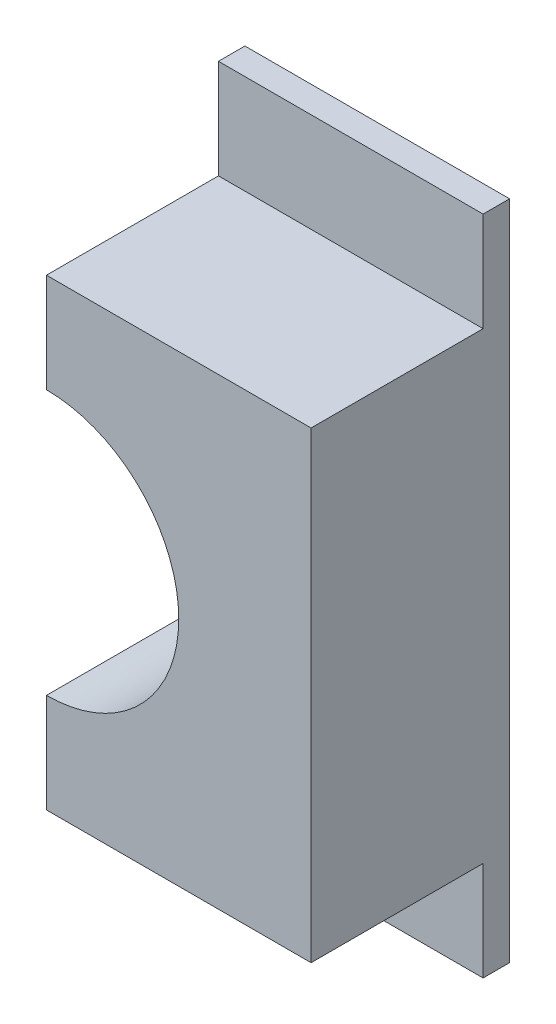
ISO-10303-21;
HEADER;
FILE_DESCRIPTION(('STEP AP214'),'2;1');
FILE_NAME('part.step','',(''),(''),'','','');
FILE_SCHEMA(('AUTOMOTIVE_DESIGN { 1 0 10303 214 1 1 1 1 }'));
ENDSEC;
DATA;
#1=APPLICATION_CONTEXT('core data for automotive mechanical design processes');
#2=APPLICATION_PROTOCOL_DEFINITION('international standard','automotive_design',2000,#1);
#3=PRODUCT_CONTEXT('',#1,'mechanical');
#4=PRODUCT('Part','Part','',(#3));
#5=PRODUCT_RELATED_PRODUCT_CATEGORY('part','',(#4));
#6=PRODUCT_DEFINITION_FORMATION('','',#4);
#7=PRODUCT_DEFINITION_CONTEXT('part definition',#1,'design');
#8=PRODUCT_DEFINITION('design','',#6,#7);
#9=PRODUCT_DEFINITION_SHAPE('','',#8);
#10=(LENGTH_UNIT() NAMED_UNIT(*) SI_UNIT(.MILLI.,.METRE.));
#11=(NAMED_UNIT(*) PLANE_ANGLE_UNIT() SI_UNIT($,.RADIAN.));
#12=(NAMED_UNIT(*) SI_UNIT($,.STERADIAN.) SOLID_ANGLE_UNIT());
#13=UNCERTAINTY_MEASURE_WITH_UNIT(LENGTH_MEASURE(1.E-05),#10,'distance_accuracy_value','');
#14=(GEOMETRIC_REPRESENTATION_CONTEXT(3) GLOBAL_UNCERTAINTY_ASSIGNED_CONTEXT((#13)) GLOBAL_UNIT_ASSIGNED_CONTEXT((#10,
#11,#12)) REPRESENTATION_CONTEXT('',''));
#15=CARTESIAN_POINT('',(0.,0.,0.));
#16=DIRECTION('',(0.,0.,1.));
#17=DIRECTION('',(1.,0.,0.));
#18=AXIS2_PLACEMENT_3D('',#15,#16,#17);
#19=CARTESIAN_POINT('',(-0.2,-0.5,0.04));
#20=DIRECTION('',(0.,0.,1.));
#21=DIRECTION('',(1.,0.,0.));
#22=AXIS2_PLACEMENT_3D('',#19,#20,#21);
#23=PLANE('',#22);
#24=DIRECTION('',(1.,0.,0.));
#25=VECTOR('',#24,1.);
#26=CARTESIAN_POINT('',(0.2,0.5,0.04));
#27=LINE('',#26,#25);
#28=CARTESIAN_POINT('',(0.2,0.5,0.04));
#29=VERTEX_POINT('',#28);
#30=CARTESIAN_POINT('',(-0.2,0.5,0.04));
#31=VERTEX_POINT('',#30);
#32=EDGE_CURVE('E156',#29,#31,#27,.F.);
#33=ORIENTED_EDGE('',*,*,#32,.T.);
#34=DIRECTION('',(0.,1.,0.));
#35=VECTOR('',#34,1.);
#36=CARTESIAN_POINT('',(-0.2,0.35,0.04));
#37=LINE('',#36,#35);
#38=CARTESIAN_POINT('',(-0.2,0.35,0.04));
#39=VERTEX_POINT('',#38);
#40=EDGE_CURVE('E146',#31,#39,#37,.F.);
#41=ORIENTED_EDGE('',*,*,#40,.T.);
#42=DIRECTION('',(1.,0.,0.));
#43=VECTOR('',#42,1.);
#44=CARTESIAN_POINT('',(0.2,0.35,0.04));
#45=LINE('',#44,#43);
#46=CARTESIAN_POINT('',(0.2,0.35,0.04));
#47=VERTEX_POINT('',#46);
#48=EDGE_CURVE('E80',#39,#47,#45,.T.);
#49=ORIENTED_EDGE('',*,*,#48,.T.);
#50=DIRECTION('',(0.,1.,0.));
#51=VECTOR('',#50,1.);
#52=CARTESIAN_POINT('',(0.2,-0.35,0.04));
#53=LINE('',#52,#51);
#54=EDGE_CURVE('E161',#47,#29,#53,.T.);
#55=ORIENTED_EDGE('',*,*,#54,.T.);
#56=EDGE_LOOP('',(#33,#41,#49,#55));
#57=FACE_BOUND('',#56,.T.);
#58=ADVANCED_FACE('F16',(#57),#23,.T.);
#59=CARTESIAN_POINT('',(0.2,0.35,0.3));
#60=DIRECTION('',(0.,-1.,0.));
#61=DIRECTION('',(0.,0.,-1.));
#62=AXIS2_PLACEMENT_3D('',#59,#60,#61);
#63=PLANE('',#62);
#64=ORIENTED_EDGE('',*,*,#48,.F.);
#65=DIRECTION('',(0.,0.,-1.));
#66=VECTOR('',#65,1.);
#67=CARTESIAN_POINT('',(-0.2,0.35,0.3));
#68=LINE('',#67,#66);
#69=CARTESIAN_POINT('',(-0.2,0.35,0.3));
#70=VERTEX_POINT('',#69);
#71=EDGE_CURVE('E138',#39,#70,#68,.F.);
#72=ORIENTED_EDGE('',*,*,#71,.T.);
#73=DIRECTION('',(1.,0.,0.));
#74=VECTOR('',#73,1.);
#75=CARTESIAN_POINT('',(-0.2,0.35,0.3));
#76=LINE('',#75,#74);
#77=CARTESIAN_POINT('',(0.2,0.35,0.3));
#78=VERTEX_POINT('',#77);
#79=EDGE_CURVE('E56',#78,#70,#76,.F.);
#80=ORIENTED_EDGE('',*,*,#79,.F.);
#81=DIRECTION('',(0.,0.,1.));
#82=VECTOR('',#81,1.);
#83=CARTESIAN_POINT('',(0.2,0.35,0.3));
#84=LINE('',#83,#82);
#85=EDGE_CURVE('E163',#78,#47,#84,.F.);
#86=ORIENTED_EDGE('',*,*,#85,.T.);
#87=EDGE_LOOP('',(#64,#72,#80,#86));
#88=FACE_BOUND('',#87,.T.);
#89=ADVANCED_FACE('F245',(#88),#63,.F.);
#90=CARTESIAN_POINT('',(-0.2,-0.35,0.3));
#91=DIRECTION('',(0.,1.,0.));
#92=DIRECTION('',(0.,0.,1.));
#93=AXIS2_PLACEMENT_3D('',#90,#91,#92);
#94=PLANE('',#93);
#95=DIRECTION('',(1.,0.,0.));
#96=VECTOR('',#95,1.);
#97=CARTESIAN_POINT('',(-0.2,-0.35,0.04));
#98=LINE('',#97,#96);
#99=CARTESIAN_POINT('',(0.2,-0.35,0.04));
#100=VERTEX_POINT('',#99);
#101=CARTESIAN_POINT('',(-0.2,-0.35,0.04));
#102=VERTEX_POINT('',#101);
#103=EDGE_CURVE('E123',#100,#102,#98,.F.);
#104=ORIENTED_EDGE('',*,*,#103,.F.);
#105=DIRECTION('',(0.,0.,1.));
#106=VECTOR('',#105,1.);
#107=CARTESIAN_POINT('',(0.2,-0.35,0.3));
#108=LINE('',#107,#106);
#109=CARTESIAN_POINT('',(0.2,-0.35,0.3));
#110=VERTEX_POINT('',#109);
#111=EDGE_CURVE('E168',#100,#110,#108,.T.);
#112=ORIENTED_EDGE('',*,*,#111,.T.);
#113=DIRECTION('',(1.,0.,0.));
#114=VECTOR('',#113,1.);
#115=CARTESIAN_POINT('',(-0.2,-0.35,0.3));
#116=LINE('',#115,#114);
#117=CARTESIAN_POINT('',(-0.2,-0.35,0.3));
#118=VERTEX_POINT('',#117);
#119=EDGE_CURVE('E133',#118,#110,#116,.T.);
#120=ORIENTED_EDGE('',*,*,#119,.F.);
#121=DIRECTION('',(0.,0.,-1.));
#122=VECTOR('',#121,1.);
#123=CARTESIAN_POINT('',(-0.2,-0.35,0.3));
#124=LINE('',#123,#122);
#125=EDGE_CURVE('E124',#118,#102,#124,.T.);
#126=ORIENTED_EDGE('',*,*,#125,.T.);
#127=EDGE_LOOP('',(#104,#112,#120,#126));
#128=FACE_BOUND('',#127,.T.);
#129=ADVANCED_FACE('F239',(#128),#94,.F.);
#130=CARTESIAN_POINT('',(-0.2,-0.5,0.04));
#131=DIRECTION('',(0.,0.,1.));
#132=DIRECTION('',(1.,0.,0.));
#133=AXIS2_PLACEMENT_3D('',#130,#131,#132);
#134=PLANE('',#133);
#135=DIRECTION('',(1.,0.,0.));
#136=VECTOR('',#135,1.);
#137=CARTESIAN_POINT('',(-0.2,-0.5,0.04));
#138=LINE('',#137,#136);
#139=CARTESIAN_POINT('',(-0.2,-0.5,0.04));
#140=VERTEX_POINT('',#139);
#141=CARTESIAN_POINT('',(0.2,-0.5,0.04));
#142=VERTEX_POINT('',#141);
#143=EDGE_CURVE('E87',#140,#142,#138,.T.);
#144=ORIENTED_EDGE('',*,*,#143,.T.);
#145=DIRECTION('',(0.,1.,0.));
#146=VECTOR('',#145,1.);
#147=CARTESIAN_POINT('',(0.2,-0.35,0.04));
#148=LINE('',#147,#146);
#149=EDGE_CURVE('E166',#142,#100,#148,.T.);
#150=ORIENTED_EDGE('',*,*,#149,.T.);
#151=ORIENTED_EDGE('',*,*,#103,.T.);
#152=DIRECTION('',(0.,1.,0.));
#153=VECTOR('',#152,1.);
#154=CARTESIAN_POINT('',(-0.2,0.35,0.04));
#155=LINE('',#154,#153);
#156=EDGE_CURVE('E119',#102,#140,#155,.F.);
#157=ORIENTED_EDGE('',*,*,#156,.T.);
#158=EDGE_LOOP('',(#144,#150,#151,#157));
#159=FACE_BOUND('',#158,.T.);
#160=ADVANCED_FACE('F122',(#159),#134,.T.);
#161=CARTESIAN_POINT('',(-0.2,-0.35,0.3));
#162=DIRECTION('',(0.,0.,1.));
#163=DIRECTION('',(1.,0.,0.));
#164=AXIS2_PLACEMENT_3D('',#161,#162,#163);
#165=PLANE('',#164);
#166=ORIENTED_EDGE('',*,*,#79,.T.);
#167=DIRECTION('',(0.,1.,0.));
#168=VECTOR('',#167,1.);
#169=CARTESIAN_POINT('',(-0.2,0.35,0.3));
#170=LINE('',#169,#168);
#171=CARTESIAN_POINT('',(-0.2,0.2,0.3));
#172=VERTEX_POINT('',#171);
#173=EDGE_CURVE('E47',#70,#172,#170,.F.);
#174=ORIENTED_EDGE('',*,*,#173,.T.);
#175=CARTESIAN_POINT('',(-0.2,0.,0.3));
#176=DIRECTION('',(0.,0.,1.));
#177=DIRECTION('',(1.,0.,0.));
#178=AXIS2_PLACEMENT_3D('',#175,#176,#177);
#179=CIRCLE('',#178,0.2);
#180=CARTESIAN_POINT('',(-0.2,-0.2,0.3));
#181=VERTEX_POINT('',#180);
#182=EDGE_CURVE('E19',#172,#181,#179,.F.);
#183=ORIENTED_EDGE('',*,*,#182,.T.);
#184=DIRECTION('',(0.,1.,0.));
#185=VECTOR('',#184,1.);
#186=CARTESIAN_POINT('',(-0.2,0.35,0.3));
#187=LINE('',#186,#185);
#188=EDGE_CURVE('E199',#181,#118,#187,.F.);
#189=ORIENTED_EDGE('',*,*,#188,.T.);
#190=ORIENTED_EDGE('',*,*,#119,.T.);
#191=DIRECTION('',(0.,1.,0.));
#192=VECTOR('',#191,1.);
#193=CARTESIAN_POINT('',(0.2,-0.35,0.3));
#194=LINE('',#193,#192);
#195=EDGE_CURVE('E115',#110,#78,#194,.T.);
#196=ORIENTED_EDGE('',*,*,#195,.T.);
#197=EDGE_LOOP('',(#166,#174,#183,#189,#190,#196));
#198=FACE_BOUND('',#197,.T.);
#199=ADVANCED_FACE('F233',(#198),#165,.T.);
#200=CARTESIAN_POINT('',(-0.2,-0.5,0.04));
#201=DIRECTION('',(0.,1.,0.));
#202=DIRECTION('',(0.,0.,1.));
#203=AXIS2_PLACEMENT_3D('',#200,#201,#202);
#204=PLANE('',#203);
#205=DIRECTION('',(0.,0.,1.));
#206=VECTOR('',#205,1.);
#207=CARTESIAN_POINT('',(0.2,-0.5,0.3));
#208=LINE('',#207,#206);
#209=CARTESIAN_POINT('',(0.2,-0.5,0.));
#210=VERTEX_POINT('',#209);
#211=EDGE_CURVE('E114',#210,#142,#208,.T.);
#212=ORIENTED_EDGE('',*,*,#211,.T.);
#213=ORIENTED_EDGE('',*,*,#143,.F.);
#214=DIRECTION('',(0.,0.,-1.));
#215=VECTOR('',#214,1.);
#216=CARTESIAN_POINT('',(-0.2,-0.5,0.3));
#217=LINE('',#216,#215);
#218=CARTESIAN_POINT('',(-0.2,-0.5,0.));
#219=VERTEX_POINT('',#218);
#220=EDGE_CURVE('E113',#140,#219,#217,.T.);
#221=ORIENTED_EDGE('',*,*,#220,.T.);
#222=DIRECTION('',(1.,0.,0.));
#223=VECTOR('',#222,1.);
#224=CARTESIAN_POINT('',(-0.2,-0.5,0.));
#225=LINE('',#224,#223);
#226=EDGE_CURVE('E106',#219,#210,#225,.T.);
#227=ORIENTED_EDGE('',*,*,#226,.T.);
#228=EDGE_LOOP('',(#212,#213,#221,#227));
#229=FACE_BOUND('',#228,.T.);
#230=ADVANCED_FACE('F112',(#229),#204,.F.);
#231=CARTESIAN_POINT('',(0.2,-0.35,0.3));
#232=DIRECTION('',(-1.,0.,0.));
#233=DIRECTION('',(0.,0.,1.));
#234=AXIS2_PLACEMENT_3D('',#231,#232,#233);
#235=PLANE('',#234);
#236=ORIENTED_EDGE('',*,*,#149,.F.);
#237=ORIENTED_EDGE('',*,*,#211,.F.);
#238=DIRECTION('',(0.,1.,0.));
#239=VECTOR('',#238,1.);
#240=CARTESIAN_POINT('',(0.2,-0.35,0.));
#241=LINE('',#240,#239);
#242=CARTESIAN_POINT('',(0.2,0.5,0.));
#243=VERTEX_POINT('',#242);
#244=EDGE_CURVE('E192',#210,#243,#241,.T.);
#245=ORIENTED_EDGE('',*,*,#244,.T.);
#246=DIRECTION('',(0.,0.,-1.));
#247=VECTOR('',#246,1.);
#248=CARTESIAN_POINT('',(0.2,0.5,0.04));
#249=LINE('',#248,#247);
#250=EDGE_CURVE('E158',#243,#29,#249,.F.);
#251=ORIENTED_EDGE('',*,*,#250,.T.);
#252=ORIENTED_EDGE('',*,*,#54,.F.);
#253=ORIENTED_EDGE('',*,*,#85,.F.);
#254=ORIENTED_EDGE('',*,*,#195,.F.);
#255=ORIENTED_EDGE('',*,*,#111,.F.);
#256=EDGE_LOOP('',(#236,#237,#245,#251,#252,#253,#254,#255));
#257=FACE_BOUND('',#256,.T.);
#258=ADVANCED_FACE('F238',(#257),#235,.F.);
#259=CARTESIAN_POINT('',(0.2,0.5,0.04));
#260=DIRECTION('',(0.,-1.,0.));
#261=DIRECTION('',(0.,0.,-1.));
#262=AXIS2_PLACEMENT_3D('',#259,#260,#261);
#263=PLANE('',#262);
#264=DIRECTION('',(0.,0.,-1.));
#265=VECTOR('',#264,1.);
#266=CARTESIAN_POINT('',(-0.2,0.5,0.3));
#267=LINE('',#266,#265);
#268=CARTESIAN_POINT('',(-0.2,0.5,0.));
#269=VERTEX_POINT('',#268);
#270=EDGE_CURVE('E153',#269,#31,#267,.F.);
#271=ORIENTED_EDGE('',*,*,#270,.T.);
#272=ORIENTED_EDGE('',*,*,#32,.F.);
#273=ORIENTED_EDGE('',*,*,#250,.F.);
#274=DIRECTION('',(1.,0.,0.));
#275=VECTOR('',#274,1.);
#276=CARTESIAN_POINT('',(-0.2,0.5,0.));
#277=LINE('',#276,#275);
#278=EDGE_CURVE('E186',#243,#269,#277,.F.);
#279=ORIENTED_EDGE('',*,*,#278,.T.);
#280=EDGE_LOOP('',(#271,#272,#273,#279));
#281=FACE_BOUND('',#280,.T.);
#282=ADVANCED_FACE('F265',(#281),#263,.F.);
#283=CARTESIAN_POINT('',(-0.2,0.35,0.3));
#284=DIRECTION('',(1.,0.,0.));
#285=DIRECTION('',(0.,0.,-1.));
#286=AXIS2_PLACEMENT_3D('',#283,#284,#285);
#287=PLANE('',#286);
#288=DIRECTION('',(0.,0.,1.));
#289=VECTOR('',#288,1.);
#290=CARTESIAN_POINT('',(-0.2,0.2,1.204159457879));
#291=LINE('',#290,#289);
#292=CARTESIAN_POINT('',(-0.2,0.2,0.));
#293=VERTEX_POINT('',#292);
#294=EDGE_CURVE('E137',#293,#172,#291,.T.);
#295=ORIENTED_EDGE('',*,*,#294,.T.);
#296=ORIENTED_EDGE('',*,*,#173,.F.);
#297=ORIENTED_EDGE('',*,*,#71,.F.);
#298=ORIENTED_EDGE('',*,*,#40,.F.);
#299=ORIENTED_EDGE('',*,*,#270,.F.);
#300=DIRECTION('',(0.,1.,0.));
#301=VECTOR('',#300,1.);
#302=CARTESIAN_POINT('',(-0.2,-0.35,0.));
#303=LINE('',#302,#301);
#304=EDGE_CURVE('E182',#269,#293,#303,.F.);
#305=ORIENTED_EDGE('',*,*,#304,.T.);
#306=EDGE_LOOP('',(#295,#296,#297,#298,#299,#305));
#307=FACE_BOUND('',#306,.T.);
#308=ADVANCED_FACE('F241',(#307),#287,.F.);
#309=CARTESIAN_POINT('',(-0.2,0.,1.204159457879));
#310=DIRECTION('',(0.,0.,1.));
#311=DIRECTION('',(1.,0.,0.));
#312=AXIS2_PLACEMENT_3D('',#309,#310,#311);
#313=CYLINDRICAL_SURFACE('',#312,0.2);
#314=ORIENTED_EDGE('',*,*,#294,.F.);
#315=CARTESIAN_POINT('',(-0.2,0.,0.));
#316=DIRECTION('',(0.,0.,1.));
#317=DIRECTION('',(1.,0.,0.));
#318=AXIS2_PLACEMENT_3D('',#315,#316,#317);
#319=CIRCLE('',#318,0.2);
#320=CARTESIAN_POINT('',(-0.2,-0.2,0.));
#321=VERTEX_POINT('',#320);
#322=EDGE_CURVE('E25',#293,#321,#319,.F.);
#323=ORIENTED_EDGE('',*,*,#322,.T.);
#324=DIRECTION('',(0.,0.,-1.));
#325=VECTOR('',#324,1.);
#326=CARTESIAN_POINT('',(-0.2,-0.2,0.3));
#327=LINE('',#326,#325);
#328=EDGE_CURVE('E33',#321,#181,#327,.F.);
#329=ORIENTED_EDGE('',*,*,#328,.T.);
#330=ORIENTED_EDGE('',*,*,#182,.F.);
#331=EDGE_LOOP('',(#314,#323,#329,#330));
#332=FACE_BOUND('',#331,.T.);
#333=ADVANCED_FACE('F240',(#332),#313,.F.);
#334=CARTESIAN_POINT('',(-0.2,0.35,0.3));
#335=DIRECTION('',(1.,0.,0.));
#336=DIRECTION('',(0.,0.,-1.));
#337=AXIS2_PLACEMENT_3D('',#334,#335,#336);
#338=PLANE('',#337);
#339=ORIENTED_EDGE('',*,*,#328,.F.);
#340=DIRECTION('',(0.,1.,0.));
#341=VECTOR('',#340,1.);
#342=CARTESIAN_POINT('',(-0.2,-0.35,0.));
#343=LINE('',#342,#341);
#344=EDGE_CURVE('E11',#321,#219,#343,.F.);
#345=ORIENTED_EDGE('',*,*,#344,.T.);
#346=ORIENTED_EDGE('',*,*,#220,.F.);
#347=ORIENTED_EDGE('',*,*,#156,.F.);
#348=ORIENTED_EDGE('',*,*,#125,.F.);
#349=ORIENTED_EDGE('',*,*,#188,.F.);
#350=EDGE_LOOP('',(#339,#345,#346,#347,#348,#349));
#351=FACE_BOUND('',#350,.T.);
#352=ADVANCED_FACE('F118',(#351),#338,.F.);
#353=CARTESIAN_POINT('',(-0.2,-0.35,0.));
#354=DIRECTION('',(0.,0.,1.));
#355=DIRECTION('',(1.,0.,0.));
#356=AXIS2_PLACEMENT_3D('',#353,#354,#355);
#357=PLANE('',#356);
#358=ORIENTED_EDGE('',*,*,#322,.F.);
#359=ORIENTED_EDGE('',*,*,#304,.F.);
#360=ORIENTED_EDGE('',*,*,#278,.F.);
#361=ORIENTED_EDGE('',*,*,#244,.F.);
#362=ORIENTED_EDGE('',*,*,#226,.F.);
#363=ORIENTED_EDGE('',*,*,#344,.F.);
#364=EDGE_LOOP('',(#358,#359,#360,#361,#362,#363));
#365=FACE_BOUND('',#364,.T.);
#366=ADVANCED_FACE('F253',(#365),#357,.F.);
#367=CLOSED_SHELL('',(#58,#89,#129,#160,#199,#230,#258,#282,#308,#333,#352,#366));
#368=MANIFOLD_SOLID_BREP('B1',#367);
#369=ADVANCED_BREP_SHAPE_REPRESENTATION('',(#18,#368),#14);
#370=SHAPE_DEFINITION_REPRESENTATION(#9,#369);
ENDSEC;
END-ISO-10303-21;
